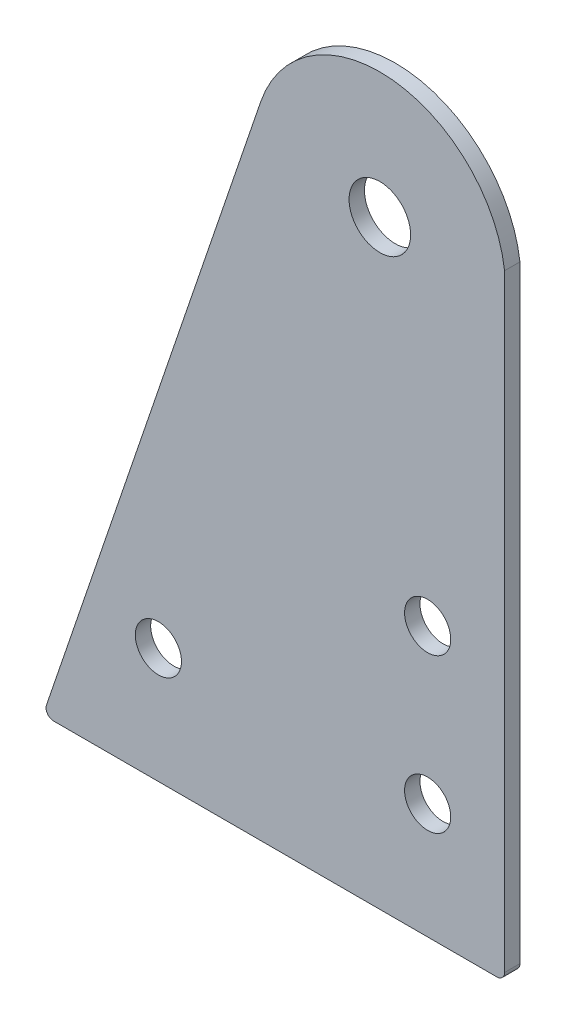
ISO-10303-21;
HEADER;
FILE_DESCRIPTION(('STEP AP214'),'2;1');
FILE_NAME('part.step','',(''),(''),'','','');
FILE_SCHEMA(('AUTOMOTIVE_DESIGN { 1 0 10303 214 1 1 1 1 }'));
ENDSEC;
DATA;
#1=APPLICATION_CONTEXT('core data for automotive mechanical design processes');
#2=APPLICATION_PROTOCOL_DEFINITION('international standard','automotive_design',2000,#1);
#3=PRODUCT_CONTEXT('',#1,'mechanical');
#4=PRODUCT('Part','Part','',(#3));
#5=PRODUCT_RELATED_PRODUCT_CATEGORY('part','',(#4));
#6=PRODUCT_DEFINITION_FORMATION('','',#4);
#7=PRODUCT_DEFINITION_CONTEXT('part definition',#1,'design');
#8=PRODUCT_DEFINITION('design','',#6,#7);
#9=PRODUCT_DEFINITION_SHAPE('','',#8);
#10=(LENGTH_UNIT() NAMED_UNIT(*) SI_UNIT(.MILLI.,.METRE.));
#11=(NAMED_UNIT(*) PLANE_ANGLE_UNIT() SI_UNIT($,.RADIAN.));
#12=(NAMED_UNIT(*) SI_UNIT($,.STERADIAN.) SOLID_ANGLE_UNIT());
#13=UNCERTAINTY_MEASURE_WITH_UNIT(LENGTH_MEASURE(1.E-05),#10,'distance_accuracy_value','');
#14=(GEOMETRIC_REPRESENTATION_CONTEXT(3) GLOBAL_UNCERTAINTY_ASSIGNED_CONTEXT((#13)) GLOBAL_UNIT_ASSIGNED_CONTEXT((#10,
#11,#12)) REPRESENTATION_CONTEXT('',''));
#15=CARTESIAN_POINT('',(0.,0.,0.));
#16=DIRECTION('',(0.,0.,1.));
#17=DIRECTION('',(1.,0.,0.));
#18=AXIS2_PLACEMENT_3D('',#15,#16,#17);
#19=CARTESIAN_POINT('',(0.,0.,2.));
#20=DIRECTION('',(-1.,0.,0.));
#21=DIRECTION('',(0.,0.,1.));
#22=AXIS2_PLACEMENT_3D('',#19,#20,#21);
#23=PLANE('',#22);
#24=DIRECTION('',(0.,1.,0.));
#25=VECTOR('',#24,1.);
#26=CARTESIAN_POINT('',(0.,0.,2.));
#27=LINE('',#26,#25);
#28=CARTESIAN_POINT('',(0.,1.,2.));
#29=VERTEX_POINT('',#28);
#30=CARTESIAN_POINT('',(0.,80.,2.));
#31=VERTEX_POINT('',#30);
#32=EDGE_CURVE('E103',#29,#31,#27,.T.);
#33=ORIENTED_EDGE('',*,*,#32,.F.);
#34=DIRECTION('',(0.,0.,-1.));
#35=VECTOR('',#34,1.);
#36=CARTESIAN_POINT('',(0.,1.,2.));
#37=LINE('',#36,#35);
#38=CARTESIAN_POINT('',(0.,1.,0.));
#39=VERTEX_POINT('',#38);
#40=EDGE_CURVE('E110',#29,#39,#37,.T.);
#41=ORIENTED_EDGE('',*,*,#40,.T.);
#42=DIRECTION('',(0.,1.,0.));
#43=VECTOR('',#42,1.);
#44=CARTESIAN_POINT('',(0.,0.,0.));
#45=LINE('',#44,#43);
#46=CARTESIAN_POINT('',(0.,80.,0.));
#47=VERTEX_POINT('',#46);
#48=EDGE_CURVE('E109',#39,#47,#45,.T.);
#49=ORIENTED_EDGE('',*,*,#48,.T.);
#50=DIRECTION('',(0.,0.,-1.));
#51=VECTOR('',#50,1.);
#52=CARTESIAN_POINT('',(0.,80.,2.));
#53=LINE('',#52,#51);
#54=EDGE_CURVE('E96',#31,#47,#53,.T.);
#55=ORIENTED_EDGE('',*,*,#54,.F.);
#56=EDGE_LOOP('',(#33,#41,#49,#55));
#57=FACE_BOUND('',#56,.T.);
#58=ADVANCED_FACE('F37',(#57),#23,.F.);
#59=CARTESIAN_POINT('',(-16.2149706208328,77.9312961356805,2.));
#60=DIRECTION('',(0.,0.,-1.));
#61=DIRECTION('',(-1.,0.,0.));
#62=AXIS2_PLACEMENT_3D('',#59,#60,#61);
#63=CYLINDRICAL_SURFACE('',#62,16.3464004573705);
#64=CARTESIAN_POINT('',(-16.2149706208328,77.9312961356805,0.));
#65=DIRECTION('',(0.,0.,1.));
#66=DIRECTION('',(1.,0.,0.));
#67=AXIS2_PLACEMENT_3D('',#64,#65,#66);
#68=CIRCLE('',#67,16.3464004573705);
#69=CARTESIAN_POINT('',(-31.6899927739787,83.1970816679982,0.));
#70=VERTEX_POINT('',#69);
#71=EDGE_CURVE('E126',#47,#70,#68,.T.);
#72=ORIENTED_EDGE('',*,*,#71,.T.);
#73=DIRECTION('',(0.,0.,-1.));
#74=VECTOR('',#73,1.);
#75=CARTESIAN_POINT('',(-31.6899927739787,83.1970816679982,2.));
#76=LINE('',#75,#74);
#77=CARTESIAN_POINT('',(-31.6899927739787,83.1970816679982,2.));
#78=VERTEX_POINT('',#77);
#79=EDGE_CURVE('E99',#78,#70,#76,.T.);
#80=ORIENTED_EDGE('',*,*,#79,.F.);
#81=CARTESIAN_POINT('',(-16.2149706208328,77.9312961356805,2.));
#82=DIRECTION('',(0.,0.,1.));
#83=DIRECTION('',(1.,0.,0.));
#84=AXIS2_PLACEMENT_3D('',#81,#82,#83);
#85=CIRCLE('',#84,16.3464004573705);
#86=EDGE_CURVE('E92',#31,#78,#85,.T.);
#87=ORIENTED_EDGE('',*,*,#86,.F.);
#88=ORIENTED_EDGE('',*,*,#54,.T.);
#89=EDGE_LOOP('',(#72,#80,#87,#88));
#90=FACE_BOUND('',#89,.T.);
#91=ADVANCED_FACE('F95',(#90),#63,.T.);
#92=CARTESIAN_POINT('',(-53.7736530665818,18.2979075270865,2.));
#93=DIRECTION('',(-0.946692955033307,0.322137313719327,0.));
#94=DIRECTION('',(-0.322137313719327,-0.946692955033307,0.));
#95=AXIS2_PLACEMENT_3D('',#92,#93,#94);
#96=PLANE('',#95);
#97=DIRECTION('',(0.322137313719327,0.946692955033308,0.));
#98=VECTOR('',#97,1.);
#99=CARTESIAN_POINT('',(-53.7736530665818,18.2979075270865,0.));
#100=LINE('',#99,#98);
#101=CARTESIAN_POINT('',(-59.5501078144237,1.32213731371932,0.));
#102=VERTEX_POINT('',#101);
#103=EDGE_CURVE('E116',#102,#70,#100,.T.);
#104=ORIENTED_EDGE('',*,*,#103,.F.);
#105=DIRECTION('',(0.,0.,-1.));
#106=VECTOR('',#105,1.);
#107=CARTESIAN_POINT('',(-59.5501078144237,1.32213731371933,2.));
#108=LINE('',#107,#106);
#109=CARTESIAN_POINT('',(-59.5501078144237,1.32213731371932,2.));
#110=VERTEX_POINT('',#109);
#111=EDGE_CURVE('E11',#102,#110,#108,.F.);
#112=ORIENTED_EDGE('',*,*,#111,.T.);
#113=DIRECTION('',(0.322137313719327,0.946692955033308,0.));
#114=VECTOR('',#113,1.);
#115=CARTESIAN_POINT('',(-53.7736530665818,18.2979075270865,2.));
#116=LINE('',#115,#114);
#117=EDGE_CURVE('E102',#110,#78,#116,.T.);
#118=ORIENTED_EDGE('',*,*,#117,.T.);
#119=ORIENTED_EDGE('',*,*,#79,.T.);
#120=EDGE_LOOP('',(#104,#112,#118,#119));
#121=FACE_BOUND('',#120,.T.);
#122=ADVANCED_FACE('F151',(#121),#96,.T.);
#123=CARTESIAN_POINT('',(0.,0.,2.));
#124=DIRECTION('',(0.,1.,0.));
#125=DIRECTION('',(0.,0.,1.));
#126=AXIS2_PLACEMENT_3D('',#123,#124,#125);
#127=PLANE('',#126);
#128=DIRECTION('',(1.,0.,0.));
#129=VECTOR('',#128,1.);
#130=CARTESIAN_POINT('',(0.,0.,0.));
#131=LINE('',#130,#129);
#132=CARTESIAN_POINT('',(-58.6034148593904,0.,0.));
#133=VERTEX_POINT('',#132);
#134=CARTESIAN_POINT('',(-1.,0.,0.));
#135=VERTEX_POINT('',#134);
#136=EDGE_CURVE('E113',#133,#135,#131,.T.);
#137=ORIENTED_EDGE('',*,*,#136,.T.);
#138=DIRECTION('',(0.,0.,-1.));
#139=VECTOR('',#138,1.);
#140=CARTESIAN_POINT('',(-1.,0.,2.));
#141=LINE('',#140,#139);
#142=CARTESIAN_POINT('',(-1.,0.,2.));
#143=VERTEX_POINT('',#142);
#144=EDGE_CURVE('E139',#135,#143,#141,.F.);
#145=ORIENTED_EDGE('',*,*,#144,.T.);
#146=DIRECTION('',(1.,0.,0.));
#147=VECTOR('',#146,1.);
#148=CARTESIAN_POINT('',(0.,0.,2.));
#149=LINE('',#148,#147);
#150=CARTESIAN_POINT('',(-58.6034148593904,0.,2.));
#151=VERTEX_POINT('',#150);
#152=EDGE_CURVE('E123',#151,#143,#149,.T.);
#153=ORIENTED_EDGE('',*,*,#152,.F.);
#154=DIRECTION('',(0.,0.,-1.));
#155=VECTOR('',#154,1.);
#156=CARTESIAN_POINT('',(-58.6034148593904,0.,0.));
#157=LINE('',#156,#155);
#158=EDGE_CURVE('E136',#151,#133,#157,.T.);
#159=ORIENTED_EDGE('',*,*,#158,.T.);
#160=EDGE_LOOP('',(#137,#145,#153,#159));
#161=FACE_BOUND('',#160,.T.);
#162=ADVANCED_FACE('F145',(#161),#127,.F.);
#163=CARTESIAN_POINT('',(0.,0.,2.));
#164=DIRECTION('',(0.,0.,1.));
#165=DIRECTION('',(1.,0.,0.));
#166=AXIS2_PLACEMENT_3D('',#163,#164,#165);
#167=PLANE('',#166);
#168=CARTESIAN_POINT('',(-10.,35.,2.));
#169=DIRECTION('',(0.,0.,1.));
#170=DIRECTION('',(1.,0.,0.));
#171=AXIS2_PLACEMENT_3D('',#168,#169,#170);
#172=CIRCLE('',#171,3.);
#173=CARTESIAN_POINT('',(-7.,35.,2.));
#174=VERTEX_POINT('',#173);
#175=EDGE_CURVE('E201',#174,#174,#172,.T.);
#176=ORIENTED_EDGE('',*,*,#175,.F.);
#177=EDGE_LOOP('',(#176));
#178=FACE_BOUND('',#177,.T.);
#179=CARTESIAN_POINT('',(-10.,15.,2.));
#180=DIRECTION('',(0.,0.,1.));
#181=DIRECTION('',(1.,0.,0.));
#182=AXIS2_PLACEMENT_3D('',#179,#180,#181);
#183=CIRCLE('',#182,3.);
#184=CARTESIAN_POINT('',(-7.,15.,2.));
#185=VERTEX_POINT('',#184);
#186=EDGE_CURVE('E206',#185,#185,#183,.T.);
#187=ORIENTED_EDGE('',*,*,#186,.F.);
#188=EDGE_LOOP('',(#187));
#189=FACE_BOUND('',#188,.T.);
#190=CARTESIAN_POINT('',(-45.,15.,2.));
#191=DIRECTION('',(0.,0.,1.));
#192=DIRECTION('',(1.,0.,0.));
#193=AXIS2_PLACEMENT_3D('',#190,#191,#192);
#194=CIRCLE('',#193,3.);
#195=CARTESIAN_POINT('',(-42.,15.,2.));
#196=VERTEX_POINT('',#195);
#197=EDGE_CURVE('E214',#196,#196,#194,.T.);
#198=ORIENTED_EDGE('',*,*,#197,.F.);
#199=EDGE_LOOP('',(#198));
#200=FACE_BOUND('',#199,.T.);
#201=CARTESIAN_POINT('',(-16.2149706208328,77.9312961356805,2.));
#202=DIRECTION('',(0.,0.,1.));
#203=DIRECTION('',(1.,0.,0.));
#204=AXIS2_PLACEMENT_3D('',#201,#202,#203);
#205=CIRCLE('',#204,4.);
#206=CARTESIAN_POINT('',(-12.2149706208328,77.9312961356805,2.));
#207=VERTEX_POINT('',#206);
#208=EDGE_CURVE('E119',#207,#207,#205,.T.);
#209=ORIENTED_EDGE('',*,*,#208,.F.);
#210=EDGE_LOOP('',(#209));
#211=FACE_BOUND('',#210,.T.);
#212=ORIENTED_EDGE('',*,*,#152,.T.);
#213=CARTESIAN_POINT('',(-1.,1.,2.));
#214=DIRECTION('',(0.,0.,1.));
#215=DIRECTION('',(1.,0.,0.));
#216=AXIS2_PLACEMENT_3D('',#213,#214,#215);
#217=CIRCLE('',#216,1.);
#218=EDGE_CURVE('E45',#143,#29,#217,.T.);
#219=ORIENTED_EDGE('',*,*,#218,.T.);
#220=ORIENTED_EDGE('',*,*,#32,.T.);
#221=ORIENTED_EDGE('',*,*,#86,.T.);
#222=ORIENTED_EDGE('',*,*,#117,.F.);
#223=CARTESIAN_POINT('',(-58.6034148593904,1.,2.));
#224=DIRECTION('',(0.,0.,1.));
#225=DIRECTION('',(1.,0.,0.));
#226=AXIS2_PLACEMENT_3D('',#223,#224,#225);
#227=CIRCLE('',#226,1.);
#228=EDGE_CURVE('E52',#110,#151,#227,.T.);
#229=ORIENTED_EDGE('',*,*,#228,.T.);
#230=EDGE_LOOP('',(#212,#219,#220,#221,#222,#229));
#231=FACE_BOUND('',#230,.T.);
#232=ADVANCED_FACE('F112',(#178,#189,#200,#211,#231),#167,.T.);
#233=CARTESIAN_POINT('',(0.,0.,0.));
#234=DIRECTION('',(0.,0.,1.));
#235=DIRECTION('',(1.,0.,0.));
#236=AXIS2_PLACEMENT_3D('',#233,#234,#235);
#237=PLANE('',#236);
#238=CARTESIAN_POINT('',(-10.,35.,0.));
#239=DIRECTION('',(0.,0.,1.));
#240=DIRECTION('',(1.,0.,0.));
#241=AXIS2_PLACEMENT_3D('',#238,#239,#240);
#242=CIRCLE('',#241,3.);
#243=CARTESIAN_POINT('',(-7.,35.,0.));
#244=VERTEX_POINT('',#243);
#245=EDGE_CURVE('E198',#244,#244,#242,.T.);
#246=ORIENTED_EDGE('',*,*,#245,.T.);
#247=EDGE_LOOP('',(#246));
#248=FACE_BOUND('',#247,.T.);
#249=CARTESIAN_POINT('',(-10.,15.,0.));
#250=DIRECTION('',(0.,0.,1.));
#251=DIRECTION('',(1.,0.,0.));
#252=AXIS2_PLACEMENT_3D('',#249,#250,#251);
#253=CIRCLE('',#252,3.);
#254=CARTESIAN_POINT('',(-7.,15.,0.));
#255=VERTEX_POINT('',#254);
#256=EDGE_CURVE('E202',#255,#255,#253,.T.);
#257=ORIENTED_EDGE('',*,*,#256,.T.);
#258=EDGE_LOOP('',(#257));
#259=FACE_BOUND('',#258,.T.);
#260=CARTESIAN_POINT('',(-45.,15.,0.));
#261=DIRECTION('',(0.,0.,1.));
#262=DIRECTION('',(1.,0.,0.));
#263=AXIS2_PLACEMENT_3D('',#260,#261,#262);
#264=CIRCLE('',#263,3.);
#265=CARTESIAN_POINT('',(-42.,15.,0.));
#266=VERTEX_POINT('',#265);
#267=EDGE_CURVE('E211',#266,#266,#264,.T.);
#268=ORIENTED_EDGE('',*,*,#267,.T.);
#269=EDGE_LOOP('',(#268));
#270=FACE_BOUND('',#269,.T.);
#271=CARTESIAN_POINT('',(-16.2149706208328,77.9312961356805,0.));
#272=DIRECTION('',(0.,0.,1.));
#273=DIRECTION('',(1.,0.,0.));
#274=AXIS2_PLACEMENT_3D('',#271,#272,#273);
#275=CIRCLE('',#274,4.);
#276=CARTESIAN_POINT('',(-12.2149706208328,77.9312961356805,0.));
#277=VERTEX_POINT('',#276);
#278=EDGE_CURVE('E127',#277,#277,#275,.T.);
#279=ORIENTED_EDGE('',*,*,#278,.T.);
#280=EDGE_LOOP('',(#279));
#281=FACE_BOUND('',#280,.T.);
#282=ORIENTED_EDGE('',*,*,#48,.F.);
#283=CARTESIAN_POINT('',(-1.,1.,0.));
#284=DIRECTION('',(0.,0.,1.));
#285=DIRECTION('',(1.,0.,0.));
#286=AXIS2_PLACEMENT_3D('',#283,#284,#285);
#287=CIRCLE('',#286,1.);
#288=EDGE_CURVE('E134',#39,#135,#287,.F.);
#289=ORIENTED_EDGE('',*,*,#288,.T.);
#290=ORIENTED_EDGE('',*,*,#136,.F.);
#291=CARTESIAN_POINT('',(-58.6034148593904,1.,0.));
#292=DIRECTION('',(0.,0.,1.));
#293=DIRECTION('',(1.,0.,0.));
#294=AXIS2_PLACEMENT_3D('',#291,#292,#293);
#295=CIRCLE('',#294,1.);
#296=EDGE_CURVE('E132',#133,#102,#295,.F.);
#297=ORIENTED_EDGE('',*,*,#296,.T.);
#298=ORIENTED_EDGE('',*,*,#103,.T.);
#299=ORIENTED_EDGE('',*,*,#71,.F.);
#300=EDGE_LOOP('',(#282,#289,#290,#297,#298,#299));
#301=FACE_BOUND('',#300,.T.);
#302=ADVANCED_FACE('F148',(#248,#259,#270,#281,#301),#237,.F.);
#303=CARTESIAN_POINT('',(-1.,1.,2.));
#304=DIRECTION('',(0.,0.,-1.));
#305=DIRECTION('',(-1.,0.,0.));
#306=AXIS2_PLACEMENT_3D('',#303,#304,#305);
#307=CYLINDRICAL_SURFACE('',#306,1.);
#308=ORIENTED_EDGE('',*,*,#218,.F.);
#309=ORIENTED_EDGE('',*,*,#144,.F.);
#310=ORIENTED_EDGE('',*,*,#288,.F.);
#311=ORIENTED_EDGE('',*,*,#40,.F.);
#312=EDGE_LOOP('',(#308,#309,#310,#311));
#313=FACE_BOUND('',#312,.T.);
#314=ADVANCED_FACE('F146',(#313),#307,.T.);
#315=CARTESIAN_POINT('',(-58.6034148593904,1.,2.));
#316=DIRECTION('',(0.,0.,1.));
#317=DIRECTION('',(1.,0.,0.));
#318=AXIS2_PLACEMENT_3D('',#315,#316,#317);
#319=CYLINDRICAL_SURFACE('',#318,1.);
#320=ORIENTED_EDGE('',*,*,#228,.F.);
#321=ORIENTED_EDGE('',*,*,#111,.F.);
#322=ORIENTED_EDGE('',*,*,#296,.F.);
#323=ORIENTED_EDGE('',*,*,#158,.F.);
#324=EDGE_LOOP('',(#320,#321,#322,#323));
#325=FACE_BOUND('',#324,.T.);
#326=ADVANCED_FACE('F39',(#325),#319,.T.);
#327=CARTESIAN_POINT('',(-16.2149706208328,77.9312961356805,0.));
#328=DIRECTION('',(0.,0.,1.));
#329=DIRECTION('',(1.,0.,0.));
#330=AXIS2_PLACEMENT_3D('',#327,#328,#329);
#331=CYLINDRICAL_SURFACE('',#330,4.);
#332=ORIENTED_EDGE('',*,*,#278,.F.);
#333=EDGE_LOOP('',(#332));
#334=FACE_BOUND('',#333,.T.);
#335=ORIENTED_EDGE('',*,*,#208,.T.);
#336=EDGE_LOOP('',(#335));
#337=FACE_BOUND('',#336,.T.);
#338=ADVANCED_FACE('F169',(#334,#337),#331,.F.);
#339=CARTESIAN_POINT('',(-45.,15.,0.));
#340=DIRECTION('',(0.,0.,1.));
#341=DIRECTION('',(1.,0.,0.));
#342=AXIS2_PLACEMENT_3D('',#339,#340,#341);
#343=CYLINDRICAL_SURFACE('',#342,3.);
#344=ORIENTED_EDGE('',*,*,#267,.F.);
#345=EDGE_LOOP('',(#344));
#346=FACE_BOUND('',#345,.T.);
#347=ORIENTED_EDGE('',*,*,#197,.T.);
#348=EDGE_LOOP('',(#347));
#349=FACE_BOUND('',#348,.T.);
#350=ADVANCED_FACE('F182',(#346,#349),#343,.F.);
#351=CARTESIAN_POINT('',(-10.,15.,0.));
#352=DIRECTION('',(0.,0.,1.));
#353=DIRECTION('',(1.,0.,0.));
#354=AXIS2_PLACEMENT_3D('',#351,#352,#353);
#355=CYLINDRICAL_SURFACE('',#354,3.);
#356=ORIENTED_EDGE('',*,*,#256,.F.);
#357=EDGE_LOOP('',(#356));
#358=FACE_BOUND('',#357,.T.);
#359=ORIENTED_EDGE('',*,*,#186,.T.);
#360=EDGE_LOOP('',(#359));
#361=FACE_BOUND('',#360,.T.);
#362=ADVANCED_FACE('F186',(#358,#361),#355,.F.);
#363=CARTESIAN_POINT('',(-10.,35.,0.));
#364=DIRECTION('',(0.,0.,1.));
#365=DIRECTION('',(1.,0.,0.));
#366=AXIS2_PLACEMENT_3D('',#363,#364,#365);
#367=CYLINDRICAL_SURFACE('',#366,3.);
#368=ORIENTED_EDGE('',*,*,#245,.F.);
#369=EDGE_LOOP('',(#368));
#370=FACE_BOUND('',#369,.T.);
#371=ORIENTED_EDGE('',*,*,#175,.T.);
#372=EDGE_LOOP('',(#371));
#373=FACE_BOUND('',#372,.T.);
#374=ADVANCED_FACE('F190',(#370,#373),#367,.F.);
#375=CLOSED_SHELL('',(#58,#91,#122,#162,#232,#302,#314,#326,#338,#350,#362,#374));
#376=MANIFOLD_SOLID_BREP('B2',#375);
#377=ADVANCED_BREP_SHAPE_REPRESENTATION('',(#18,#376),#14);
#378=SHAPE_DEFINITION_REPRESENTATION(#9,#377);
ENDSEC;
END-ISO-10303-21;
